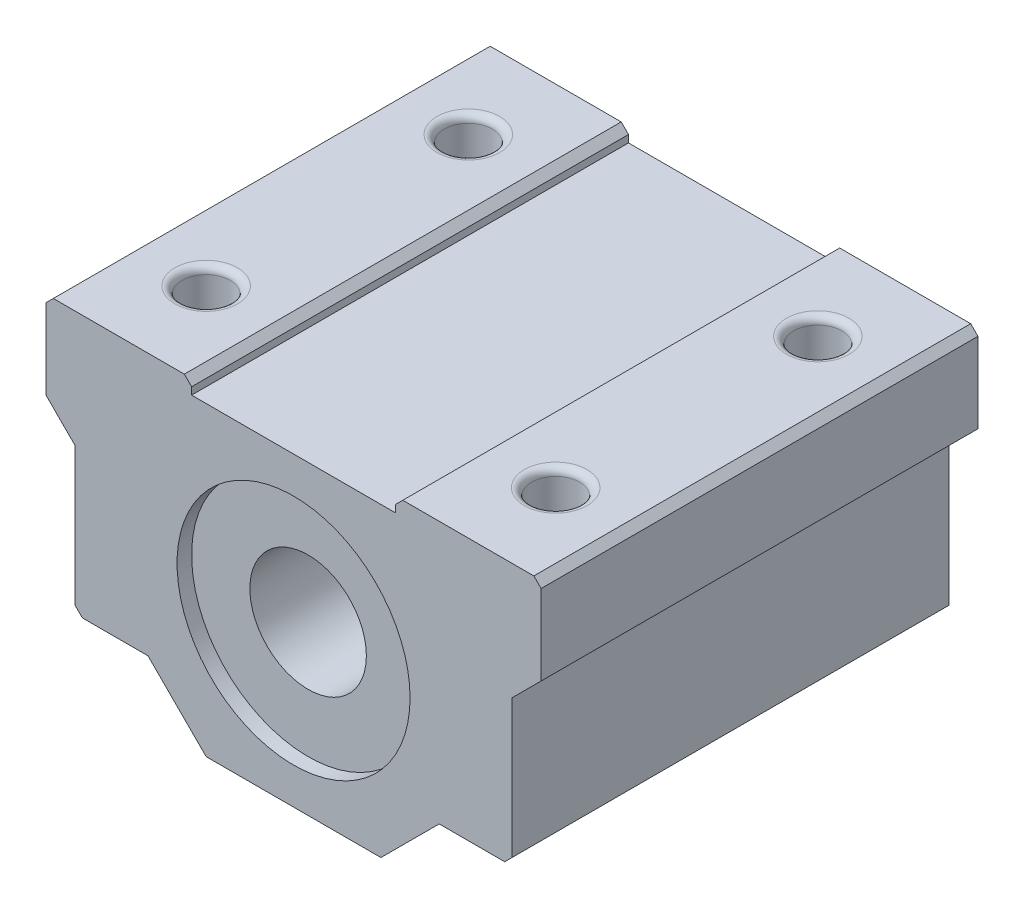
ISO-10303-21;
HEADER;
FILE_DESCRIPTION(('STEP AP214'),'2;1');
FILE_NAME('part.step','',(''),(''),'','','');
FILE_SCHEMA(('AUTOMOTIVE_DESIGN { 1 0 10303 214 1 1 1 1 }'));
ENDSEC;
DATA;
#1=APPLICATION_CONTEXT('core data for automotive mechanical design processes');
#2=APPLICATION_PROTOCOL_DEFINITION('international standard','automotive_design',2000,#1);
#3=PRODUCT_CONTEXT('',#1,'mechanical');
#4=PRODUCT('Part','Part','',(#3));
#5=PRODUCT_RELATED_PRODUCT_CATEGORY('part','',(#4));
#6=PRODUCT_DEFINITION_FORMATION('','',#4);
#7=PRODUCT_DEFINITION_CONTEXT('part definition',#1,'design');
#8=PRODUCT_DEFINITION('design','',#6,#7);
#9=PRODUCT_DEFINITION_SHAPE('','',#8);
#10=(LENGTH_UNIT() NAMED_UNIT(*) SI_UNIT(.MILLI.,.METRE.));
#11=(NAMED_UNIT(*) PLANE_ANGLE_UNIT() SI_UNIT($,.RADIAN.));
#12=(NAMED_UNIT(*) SI_UNIT($,.STERADIAN.) SOLID_ANGLE_UNIT());
#13=UNCERTAINTY_MEASURE_WITH_UNIT(LENGTH_MEASURE(1.E-05),#10,'distance_accuracy_value','');
#14=(GEOMETRIC_REPRESENTATION_CONTEXT(3) GLOBAL_UNCERTAINTY_ASSIGNED_CONTEXT((#13)) GLOBAL_UNIT_ASSIGNED_CONTEXT((#10,
#11,#12)) REPRESENTATION_CONTEXT('',''));
#15=CARTESIAN_POINT('',(0.,0.,0.));
#16=DIRECTION('',(0.,0.,1.));
#17=DIRECTION('',(1.,0.,0.));
#18=AXIS2_PLACEMENT_3D('',#15,#16,#17);
#19=CARTESIAN_POINT('',(0.,0.,15.));
#20=DIRECTION('',(0.,0.,-1.));
#21=DIRECTION('',(-1.,0.,0.));
#22=AXIS2_PLACEMENT_3D('',#19,#20,#21);
#23=CYLINDRICAL_SURFACE('',#22,8.);
#24=CARTESIAN_POINT('',(0.,0.,-15.));
#25=DIRECTION('',(0.,0.,1.));
#26=DIRECTION('',(1.,0.,0.));
#27=AXIS2_PLACEMENT_3D('',#24,#25,#26);
#28=CIRCLE('',#27,8.);
#29=CARTESIAN_POINT('',(8.,0.,-15.));
#30=VERTEX_POINT('',#29);
#31=EDGE_CURVE('E434',#30,#30,#28,.T.);
#32=ORIENTED_EDGE('',*,*,#31,.F.);
#33=EDGE_LOOP('',(#32));
#34=FACE_BOUND('',#33,.T.);
#35=CARTESIAN_POINT('',(0.,0.,-14.));
#36=DIRECTION('',(0.,0.,1.));
#37=DIRECTION('',(1.,0.,0.));
#38=AXIS2_PLACEMENT_3D('',#35,#36,#37);
#39=CIRCLE('',#38,8.);
#40=CARTESIAN_POINT('',(8.,0.,-14.));
#41=VERTEX_POINT('',#40);
#42=EDGE_CURVE('E771',#41,#41,#39,.T.);
#43=ORIENTED_EDGE('',*,*,#42,.T.);
#44=EDGE_LOOP('',(#43));
#45=FACE_BOUND('',#44,.T.);
#46=ADVANCED_FACE('F43',(#34,#45),#23,.F.);
#47=CARTESIAN_POINT('',(0.,0.,15.));
#48=DIRECTION('',(0.,0.,-1.));
#49=DIRECTION('',(-1.,0.,0.));
#50=AXIS2_PLACEMENT_3D('',#47,#48,#49);
#51=PLANE('',#50);
#52=DIRECTION('',(1.,0.,0.));
#53=VECTOR('',#52,1.);
#54=CARTESIAN_POINT('',(10.,-6.5,15.));
#55=LINE('',#54,#53);
#56=CARTESIAN_POINT('',(10.,-6.5,15.));
#57=VERTEX_POINT('',#56);
#58=CARTESIAN_POINT('',(14.5,-6.5,15.));
#59=VERTEX_POINT('',#58);
#60=EDGE_CURVE('E452',#57,#59,#55,.T.);
#61=ORIENTED_EDGE('',*,*,#60,.T.);
#62=DIRECTION('',(-0.707106781186548,-0.707106781186548,0.));
#63=VECTOR('',#62,1.);
#64=CARTESIAN_POINT('',(15.,-6.,15.));
#65=LINE('',#64,#63);
#66=CARTESIAN_POINT('',(15.,-6.,15.));
#67=VERTEX_POINT('',#66);
#68=EDGE_CURVE('E277',#59,#67,#65,.F.);
#69=ORIENTED_EDGE('',*,*,#68,.T.);
#70=DIRECTION('',(0.,1.,0.));
#71=VECTOR('',#70,1.);
#72=CARTESIAN_POINT('',(15.,-6.5,15.));
#73=LINE('',#72,#71);
#74=CARTESIAN_POINT('',(15.,3.5,15.));
#75=VERTEX_POINT('',#74);
#76=EDGE_CURVE('E454',#67,#75,#73,.T.);
#77=ORIENTED_EDGE('',*,*,#76,.T.);
#78=DIRECTION('',(0.707106781186547,0.707106781186547,0.));
#79=VECTOR('',#78,1.);
#80=CARTESIAN_POINT('',(15.,3.5,15.));
#81=LINE('',#80,#79);
#82=CARTESIAN_POINT('',(17.,5.5,15.));
#83=VERTEX_POINT('',#82);
#84=EDGE_CURVE('E456',#75,#83,#81,.T.);
#85=ORIENTED_EDGE('',*,*,#84,.T.);
#86=DIRECTION('',(0.,1.,0.));
#87=VECTOR('',#86,1.);
#88=CARTESIAN_POINT('',(17.,5.5,15.));
#89=LINE('',#88,#87);
#90=CARTESIAN_POINT('',(17.,11.,15.));
#91=VERTEX_POINT('',#90);
#92=EDGE_CURVE('E313',#83,#91,#89,.T.);
#93=ORIENTED_EDGE('',*,*,#92,.T.);
#94=DIRECTION('',(0.707106781186543,-0.707106781186552,0.));
#95=VECTOR('',#94,1.);
#96=CARTESIAN_POINT('',(16.5,11.5,15.));
#97=LINE('',#96,#95);
#98=CARTESIAN_POINT('',(16.5,11.5,15.));
#99=VERTEX_POINT('',#98);
#100=EDGE_CURVE('E269',#91,#99,#97,.F.);
#101=ORIENTED_EDGE('',*,*,#100,.T.);
#102=DIRECTION('',(-1.,0.,0.));
#103=VECTOR('',#102,1.);
#104=CARTESIAN_POINT('',(7.,11.5,15.));
#105=LINE('',#104,#103);
#106=CARTESIAN_POINT('',(7.5,11.5,15.));
#107=VERTEX_POINT('',#106);
#108=EDGE_CURVE('E303',#99,#107,#105,.T.);
#109=ORIENTED_EDGE('',*,*,#108,.T.);
#110=DIRECTION('',(0.707106781186548,0.707106781186548,0.));
#111=VECTOR('',#110,1.);
#112=CARTESIAN_POINT('',(7.,11.,15.));
#113=LINE('',#112,#111);
#114=CARTESIAN_POINT('',(7.,11.,15.));
#115=VERTEX_POINT('',#114);
#116=EDGE_CURVE('E271',#107,#115,#113,.F.);
#117=ORIENTED_EDGE('',*,*,#116,.T.);
#118=DIRECTION('',(0.,-1.,0.));
#119=VECTOR('',#118,1.);
#120=CARTESIAN_POINT('',(7.,10.5,15.));
#121=LINE('',#120,#119);
#122=CARTESIAN_POINT('',(7.,10.5,15.));
#123=VERTEX_POINT('',#122);
#124=EDGE_CURVE('E312',#115,#123,#121,.T.);
#125=ORIENTED_EDGE('',*,*,#124,.T.);
#126=DIRECTION('',(-1.,0.,0.));
#127=VECTOR('',#126,1.);
#128=CARTESIAN_POINT('',(-7.,10.5,15.));
#129=LINE('',#128,#127);
#130=CARTESIAN_POINT('',(-7.,10.5,15.));
#131=VERTEX_POINT('',#130);
#132=EDGE_CURVE('E460',#123,#131,#129,.T.);
#133=ORIENTED_EDGE('',*,*,#132,.T.);
#134=DIRECTION('',(0.,1.,0.));
#135=VECTOR('',#134,1.);
#136=CARTESIAN_POINT('',(-7.,10.5,15.));
#137=LINE('',#136,#135);
#138=CARTESIAN_POINT('',(-7.,11.,15.));
#139=VERTEX_POINT('',#138);
#140=EDGE_CURVE('E462',#131,#139,#137,.T.);
#141=ORIENTED_EDGE('',*,*,#140,.T.);
#142=DIRECTION('',(0.707106781186548,-0.707106781186548,0.));
#143=VECTOR('',#142,1.);
#144=CARTESIAN_POINT('',(-7.5,11.5,15.));
#145=LINE('',#144,#143);
#146=CARTESIAN_POINT('',(-7.5,11.5,15.));
#147=VERTEX_POINT('',#146);
#148=EDGE_CURVE('E65',#139,#147,#145,.F.);
#149=ORIENTED_EDGE('',*,*,#148,.T.);
#150=DIRECTION('',(-1.,0.,0.));
#151=VECTOR('',#150,1.);
#152=CARTESIAN_POINT('',(-17.,11.5,15.));
#153=LINE('',#152,#151);
#154=CARTESIAN_POINT('',(-16.5,11.5,15.));
#155=VERTEX_POINT('',#154);
#156=EDGE_CURVE('E344',#147,#155,#153,.T.);
#157=ORIENTED_EDGE('',*,*,#156,.T.);
#158=DIRECTION('',(0.707106781186548,0.707106781186548,0.));
#159=VECTOR('',#158,1.);
#160=CARTESIAN_POINT('',(-17.,11.,15.));
#161=LINE('',#160,#159);
#162=CARTESIAN_POINT('',(-17.,11.,15.));
#163=VERTEX_POINT('',#162);
#164=EDGE_CURVE('E200',#155,#163,#161,.F.);
#165=ORIENTED_EDGE('',*,*,#164,.T.);
#166=DIRECTION('',(0.,-1.,0.));
#167=VECTOR('',#166,1.);
#168=CARTESIAN_POINT('',(-17.,5.5,15.));
#169=LINE('',#168,#167);
#170=CARTESIAN_POINT('',(-17.,5.5,15.));
#171=VERTEX_POINT('',#170);
#172=EDGE_CURVE('E191',#163,#171,#169,.T.);
#173=ORIENTED_EDGE('',*,*,#172,.T.);
#174=DIRECTION('',(0.707106781186547,-0.707106781186547,0.));
#175=VECTOR('',#174,1.);
#176=CARTESIAN_POINT('',(-15.,3.5,15.));
#177=LINE('',#176,#175);
#178=CARTESIAN_POINT('',(-15.,3.5,15.));
#179=VERTEX_POINT('',#178);
#180=EDGE_CURVE('E197',#171,#179,#177,.T.);
#181=ORIENTED_EDGE('',*,*,#180,.T.);
#182=DIRECTION('',(0.,-1.,0.));
#183=VECTOR('',#182,1.);
#184=CARTESIAN_POINT('',(-15.,-6.5,15.));
#185=LINE('',#184,#183);
#186=CARTESIAN_POINT('',(-15.,-6.,15.));
#187=VERTEX_POINT('',#186);
#188=EDGE_CURVE('E214',#179,#187,#185,.T.);
#189=ORIENTED_EDGE('',*,*,#188,.T.);
#190=DIRECTION('',(-0.707106781186548,0.707106781186548,0.));
#191=VECTOR('',#190,1.);
#192=CARTESIAN_POINT('',(-14.5,-6.5,15.));
#193=LINE('',#192,#191);
#194=CARTESIAN_POINT('',(-14.5,-6.5,15.));
#195=VERTEX_POINT('',#194);
#196=EDGE_CURVE('E275',#187,#195,#193,.F.);
#197=ORIENTED_EDGE('',*,*,#196,.T.);
#198=DIRECTION('',(1.,0.,0.));
#199=VECTOR('',#198,1.);
#200=CARTESIAN_POINT('',(-10.,-6.5,15.));
#201=LINE('',#200,#199);
#202=CARTESIAN_POINT('',(-10.,-6.5,15.));
#203=VERTEX_POINT('',#202);
#204=EDGE_CURVE('E445',#195,#203,#201,.T.);
#205=ORIENTED_EDGE('',*,*,#204,.T.);
#206=DIRECTION('',(0.707106781186548,-0.707106781186548,0.));
#207=VECTOR('',#206,1.);
#208=CARTESIAN_POINT('',(-6.,-10.5,15.));
#209=LINE('',#208,#207);
#210=CARTESIAN_POINT('',(-6.,-10.5,15.));
#211=VERTEX_POINT('',#210);
#212=EDGE_CURVE('E368',#203,#211,#209,.T.);
#213=ORIENTED_EDGE('',*,*,#212,.T.);
#214=DIRECTION('',(1.,0.,0.));
#215=VECTOR('',#214,1.);
#216=CARTESIAN_POINT('',(-6.,-10.5,15.));
#217=LINE('',#216,#215);
#218=CARTESIAN_POINT('',(6.,-10.5,15.));
#219=VERTEX_POINT('',#218);
#220=EDGE_CURVE('E448',#211,#219,#217,.T.);
#221=ORIENTED_EDGE('',*,*,#220,.T.);
#222=DIRECTION('',(0.707106781186548,0.707106781186547,0.));
#223=VECTOR('',#222,1.);
#224=CARTESIAN_POINT('',(6.,-10.5,15.));
#225=LINE('',#224,#223);
#226=EDGE_CURVE('E450',#219,#57,#225,.T.);
#227=ORIENTED_EDGE('',*,*,#226,.T.);
#228=EDGE_LOOP('',(#61,#69,#77,#85,#93,#101,#109,#117,#125,#133,#141,#149,#157,#165,#173,#181,
#189,#197,#205,#213,#221,#227));
#229=FACE_BOUND('',#228,.T.);
#230=CARTESIAN_POINT('',(0.,0.,15.));
#231=DIRECTION('',(0.,0.,1.));
#232=DIRECTION('',(1.,0.,0.));
#233=AXIS2_PLACEMENT_3D('',#230,#231,#232);
#234=CIRCLE('',#233,8.);
#235=CARTESIAN_POINT('',(8.,0.,15.));
#236=VERTEX_POINT('',#235);
#237=EDGE_CURVE('E433',#236,#236,#234,.T.);
#238=ORIENTED_EDGE('',*,*,#237,.F.);
#239=EDGE_LOOP('',(#238));
#240=FACE_BOUND('',#239,.T.);
#241=ADVANCED_FACE('F194',(#229,#240),#51,.F.);
#242=CARTESIAN_POINT('',(0.,0.,-15.));
#243=DIRECTION('',(0.,0.,-1.));
#244=DIRECTION('',(-1.,0.,0.));
#245=AXIS2_PLACEMENT_3D('',#242,#243,#244);
#246=PLANE('',#245);
#247=DIRECTION('',(0.,1.,0.));
#248=VECTOR('',#247,1.);
#249=CARTESIAN_POINT('',(15.,-6.5,-15.));
#250=LINE('',#249,#248);
#251=CARTESIAN_POINT('',(15.,-6.,-15.));
#252=VERTEX_POINT('',#251);
#253=CARTESIAN_POINT('',(15.,3.5,-15.));
#254=VERTEX_POINT('',#253);
#255=EDGE_CURVE('E387',#252,#254,#250,.T.);
#256=ORIENTED_EDGE('',*,*,#255,.F.);
#257=DIRECTION('',(0.707106781186548,0.707106781186548,0.));
#258=VECTOR('',#257,1.);
#259=CARTESIAN_POINT('',(10.5,-10.5,-15.));
#260=LINE('',#259,#258);
#261=CARTESIAN_POINT('',(14.5,-6.5,-15.));
#262=VERTEX_POINT('',#261);
#263=EDGE_CURVE('E265',#252,#262,#260,.F.);
#264=ORIENTED_EDGE('',*,*,#263,.T.);
#265=DIRECTION('',(1.,0.,0.));
#266=VECTOR('',#265,1.);
#267=CARTESIAN_POINT('',(10.,-6.5,-15.));
#268=LINE('',#267,#266);
#269=CARTESIAN_POINT('',(10.,-6.5,-15.));
#270=VERTEX_POINT('',#269);
#271=EDGE_CURVE('E384',#270,#262,#268,.T.);
#272=ORIENTED_EDGE('',*,*,#271,.F.);
#273=DIRECTION('',(0.707106781186548,0.707106781186547,0.));
#274=VECTOR('',#273,1.);
#275=CARTESIAN_POINT('',(6.,-10.5,-15.));
#276=LINE('',#275,#274);
#277=CARTESIAN_POINT('',(6.,-10.5,-15.));
#278=VERTEX_POINT('',#277);
#279=EDGE_CURVE('E377',#278,#270,#276,.T.);
#280=ORIENTED_EDGE('',*,*,#279,.F.);
#281=DIRECTION('',(1.,0.,0.));
#282=VECTOR('',#281,1.);
#283=CARTESIAN_POINT('',(-6.,-10.5,-15.));
#284=LINE('',#283,#282);
#285=CARTESIAN_POINT('',(-6.,-10.5,-15.));
#286=VERTEX_POINT('',#285);
#287=EDGE_CURVE('E375',#286,#278,#284,.T.);
#288=ORIENTED_EDGE('',*,*,#287,.F.);
#289=DIRECTION('',(0.707106781186548,-0.707106781186548,0.));
#290=VECTOR('',#289,1.);
#291=CARTESIAN_POINT('',(-6.,-10.5,-15.));
#292=LINE('',#291,#290);
#293=CARTESIAN_POINT('',(-10.,-6.5,-15.));
#294=VERTEX_POINT('',#293);
#295=EDGE_CURVE('E367',#294,#286,#292,.T.);
#296=ORIENTED_EDGE('',*,*,#295,.F.);
#297=DIRECTION('',(1.,0.,0.));
#298=VECTOR('',#297,1.);
#299=CARTESIAN_POINT('',(-10.,-6.5,-15.));
#300=LINE('',#299,#298);
#301=CARTESIAN_POINT('',(-14.5,-6.5,-15.));
#302=VERTEX_POINT('',#301);
#303=EDGE_CURVE('E373',#302,#294,#300,.T.);
#304=ORIENTED_EDGE('',*,*,#303,.F.);
#305=DIRECTION('',(0.707106781186548,-0.707106781186548,0.));
#306=VECTOR('',#305,1.);
#307=CARTESIAN_POINT('',(-10.5,-10.5,-15.));
#308=LINE('',#307,#306);
#309=CARTESIAN_POINT('',(-15.,-6.,-15.));
#310=VERTEX_POINT('',#309);
#311=EDGE_CURVE('E263',#302,#310,#308,.F.);
#312=ORIENTED_EDGE('',*,*,#311,.T.);
#313=DIRECTION('',(0.,-1.,0.));
#314=VECTOR('',#313,1.);
#315=CARTESIAN_POINT('',(-15.,-6.5,-15.));
#316=LINE('',#315,#314);
#317=CARTESIAN_POINT('',(-15.,3.5,-15.));
#318=VERTEX_POINT('',#317);
#319=EDGE_CURVE('E379',#318,#310,#316,.T.);
#320=ORIENTED_EDGE('',*,*,#319,.F.);
#321=DIRECTION('',(0.707106781186547,-0.707106781186547,0.));
#322=VECTOR('',#321,1.);
#323=CARTESIAN_POINT('',(-15.,3.5,-15.));
#324=LINE('',#323,#322);
#325=CARTESIAN_POINT('',(-17.,5.5,-15.));
#326=VERTEX_POINT('',#325);
#327=EDGE_CURVE('E436',#326,#318,#324,.T.);
#328=ORIENTED_EDGE('',*,*,#327,.F.);
#329=DIRECTION('',(0.,-1.,0.));
#330=VECTOR('',#329,1.);
#331=CARTESIAN_POINT('',(-17.,5.5,-15.));
#332=LINE('',#331,#330);
#333=CARTESIAN_POINT('',(-17.,11.,-15.));
#334=VERTEX_POINT('',#333);
#335=EDGE_CURVE('E218',#334,#326,#332,.T.);
#336=ORIENTED_EDGE('',*,*,#335,.F.);
#337=DIRECTION('',(-0.707106781186548,-0.707106781186548,0.));
#338=VECTOR('',#337,1.);
#339=CARTESIAN_POINT('',(-14.,14.,-15.));
#340=LINE('',#339,#338);
#341=CARTESIAN_POINT('',(-16.5,11.5,-15.));
#342=VERTEX_POINT('',#341);
#343=EDGE_CURVE('E261',#334,#342,#340,.F.);
#344=ORIENTED_EDGE('',*,*,#343,.T.);
#345=DIRECTION('',(-1.,0.,0.));
#346=VECTOR('',#345,1.);
#347=CARTESIAN_POINT('',(-17.,11.5,-15.));
#348=LINE('',#347,#346);
#349=CARTESIAN_POINT('',(-7.5,11.5,-15.));
#350=VERTEX_POINT('',#349);
#351=EDGE_CURVE('E205',#350,#342,#348,.T.);
#352=ORIENTED_EDGE('',*,*,#351,.F.);
#353=DIRECTION('',(-0.707106781186548,0.707106781186548,0.));
#354=VECTOR('',#353,1.);
#355=CARTESIAN_POINT('',(2.,2.,-15.));
#356=LINE('',#355,#354);
#357=CARTESIAN_POINT('',(-7.,11.,-15.));
#358=VERTEX_POINT('',#357);
#359=EDGE_CURVE('E259',#350,#358,#356,.F.);
#360=ORIENTED_EDGE('',*,*,#359,.T.);
#361=DIRECTION('',(0.,1.,0.));
#362=VECTOR('',#361,1.);
#363=CARTESIAN_POINT('',(-7.,10.5,-15.));
#364=LINE('',#363,#362);
#365=CARTESIAN_POINT('',(-7.,10.5,-15.));
#366=VERTEX_POINT('',#365);
#367=EDGE_CURVE('E331',#366,#358,#364,.T.);
#368=ORIENTED_EDGE('',*,*,#367,.F.);
#369=DIRECTION('',(-1.,0.,0.));
#370=VECTOR('',#369,1.);
#371=CARTESIAN_POINT('',(-7.,10.5,-15.));
#372=LINE('',#371,#370);
#373=CARTESIAN_POINT('',(7.,10.5,-15.));
#374=VERTEX_POINT('',#373);
#375=EDGE_CURVE('E329',#374,#366,#372,.T.);
#376=ORIENTED_EDGE('',*,*,#375,.F.);
#377=DIRECTION('',(0.,-1.,0.));
#378=VECTOR('',#377,1.);
#379=CARTESIAN_POINT('',(7.,10.5,-15.));
#380=LINE('',#379,#378);
#381=CARTESIAN_POINT('',(7.,11.,-15.));
#382=VERTEX_POINT('',#381);
#383=EDGE_CURVE('E321',#382,#374,#380,.T.);
#384=ORIENTED_EDGE('',*,*,#383,.F.);
#385=DIRECTION('',(-0.707106781186548,-0.707106781186548,0.));
#386=VECTOR('',#385,1.);
#387=CARTESIAN_POINT('',(-2.,2.,-15.));
#388=LINE('',#387,#386);
#389=CARTESIAN_POINT('',(7.5,11.5,-15.));
#390=VERTEX_POINT('',#389);
#391=EDGE_CURVE('E257',#382,#390,#388,.F.);
#392=ORIENTED_EDGE('',*,*,#391,.T.);
#393=DIRECTION('',(-1.,0.,0.));
#394=VECTOR('',#393,1.);
#395=CARTESIAN_POINT('',(7.,11.5,-15.));
#396=LINE('',#395,#394);
#397=CARTESIAN_POINT('',(16.5,11.5,-15.));
#398=VERTEX_POINT('',#397);
#399=EDGE_CURVE('E306',#398,#390,#396,.T.);
#400=ORIENTED_EDGE('',*,*,#399,.F.);
#401=DIRECTION('',(-0.707106781186543,0.707106781186552,0.));
#402=VECTOR('',#401,1.);
#403=CARTESIAN_POINT('',(14.0000000000001,13.9999999999999,-15.));
#404=LINE('',#403,#402);
#405=CARTESIAN_POINT('',(17.,11.,-15.));
#406=VERTEX_POINT('',#405);
#407=EDGE_CURVE('E255',#398,#406,#404,.F.);
#408=ORIENTED_EDGE('',*,*,#407,.T.);
#409=DIRECTION('',(0.,1.,0.));
#410=VECTOR('',#409,1.);
#411=CARTESIAN_POINT('',(17.,5.5,-15.));
#412=LINE('',#411,#410);
#413=CARTESIAN_POINT('',(17.,5.5,-15.));
#414=VERTEX_POINT('',#413);
#415=EDGE_CURVE('E333',#414,#406,#412,.T.);
#416=ORIENTED_EDGE('',*,*,#415,.F.);
#417=DIRECTION('',(0.707106781186547,0.707106781186547,0.));
#418=VECTOR('',#417,1.);
#419=CARTESIAN_POINT('',(15.,3.5,-15.));
#420=LINE('',#419,#418);
#421=EDGE_CURVE('E389',#254,#414,#420,.T.);
#422=ORIENTED_EDGE('',*,*,#421,.F.);
#423=EDGE_LOOP('',(#256,#264,#272,#280,#288,#296,#304,#312,#320,#328,#336,#344,#352,#360,#368,
#376,#384,#392,#400,#408,#416,#422));
#424=FACE_BOUND('',#423,.T.);
#425=ORIENTED_EDGE('',*,*,#31,.T.);
#426=EDGE_LOOP('',(#425));
#427=FACE_BOUND('',#426,.T.);
#428=ADVANCED_FACE('F326',(#424,#427),#246,.T.);
#429=CARTESIAN_POINT('',(-17.,5.5,15.));
#430=DIRECTION('',(1.,0.,0.));
#431=DIRECTION('',(0.,0.,-1.));
#432=AXIS2_PLACEMENT_3D('',#429,#430,#431);
#433=PLANE('',#432);
#434=ORIENTED_EDGE('',*,*,#172,.F.);
#435=DIRECTION('',(0.,0.,-1.));
#436=VECTOR('',#435,1.);
#437=CARTESIAN_POINT('',(-17.,11.,15.));
#438=LINE('',#437,#436);
#439=EDGE_CURVE('E284',#163,#334,#438,.T.);
#440=ORIENTED_EDGE('',*,*,#439,.T.);
#441=ORIENTED_EDGE('',*,*,#335,.T.);
#442=DIRECTION('',(0.,0.,-1.));
#443=VECTOR('',#442,1.);
#444=CARTESIAN_POINT('',(-17.,5.5,15.));
#445=LINE('',#444,#443);
#446=EDGE_CURVE('E210',#171,#326,#445,.T.);
#447=ORIENTED_EDGE('',*,*,#446,.F.);
#448=EDGE_LOOP('',(#434,#440,#441,#447));
#449=FACE_BOUND('',#448,.T.);
#450=ADVANCED_FACE('F216',(#449),#433,.F.);
#451=CARTESIAN_POINT('',(-15.,3.5,15.));
#452=DIRECTION('',(0.707106781186547,0.707106781186547,0.));
#453=DIRECTION('',(-0.707106781186548,0.707106781186548,0.));
#454=AXIS2_PLACEMENT_3D('',#451,#452,#453);
#455=PLANE('',#454);
#456=ORIENTED_EDGE('',*,*,#327,.T.);
#457=DIRECTION('',(0.,0.,-1.));
#458=VECTOR('',#457,1.);
#459=CARTESIAN_POINT('',(-15.,3.5,15.));
#460=LINE('',#459,#458);
#461=EDGE_CURVE('E212',#179,#318,#460,.T.);
#462=ORIENTED_EDGE('',*,*,#461,.F.);
#463=ORIENTED_EDGE('',*,*,#180,.F.);
#464=ORIENTED_EDGE('',*,*,#446,.T.);
#465=EDGE_LOOP('',(#456,#462,#463,#464));
#466=FACE_BOUND('',#465,.T.);
#467=ADVANCED_FACE('F209',(#466),#455,.F.);
#468=CARTESIAN_POINT('',(-15.,-6.5,15.));
#469=DIRECTION('',(1.,0.,0.));
#470=DIRECTION('',(0.,0.,-1.));
#471=AXIS2_PLACEMENT_3D('',#468,#469,#470);
#472=PLANE('',#471);
#473=ORIENTED_EDGE('',*,*,#319,.T.);
#474=DIRECTION('',(0.,0.,1.));
#475=VECTOR('',#474,1.);
#476=CARTESIAN_POINT('',(-15.,-6.,15.));
#477=LINE('',#476,#475);
#478=EDGE_CURVE('E282',#310,#187,#477,.T.);
#479=ORIENTED_EDGE('',*,*,#478,.T.);
#480=ORIENTED_EDGE('',*,*,#188,.F.);
#481=ORIENTED_EDGE('',*,*,#461,.T.);
#482=EDGE_LOOP('',(#473,#479,#480,#481));
#483=FACE_BOUND('',#482,.T.);
#484=ADVANCED_FACE('F469',(#483),#472,.F.);
#485=CARTESIAN_POINT('',(-10.,-6.5,15.));
#486=DIRECTION('',(0.,1.,0.));
#487=DIRECTION('',(0.,0.,1.));
#488=AXIS2_PLACEMENT_3D('',#485,#486,#487);
#489=PLANE('',#488);
#490=CARTESIAN_POINT('',(-12.,-6.5,9.));
#491=DIRECTION('',(0.,1.,0.));
#492=DIRECTION('',(0.,0.,1.));
#493=AXIS2_PLACEMENT_3D('',#490,#491,#492);
#494=CIRCLE('',#493,1.65);
#495=CARTESIAN_POINT('',(-12.,-6.5,10.65));
#496=VERTEX_POINT('',#495);
#497=EDGE_CURVE('E776',#496,#496,#494,.T.);
#498=ORIENTED_EDGE('',*,*,#497,.T.);
#499=EDGE_LOOP('',(#498));
#500=FACE_BOUND('',#499,.T.);
#501=CARTESIAN_POINT('',(-12.,-6.5,-9.));
#502=DIRECTION('',(0.,1.,0.));
#503=DIRECTION('',(0.,0.,1.));
#504=AXIS2_PLACEMENT_3D('',#501,#502,#503);
#505=CIRCLE('',#504,1.65);
#506=CARTESIAN_POINT('',(-12.,-6.5,-7.35));
#507=VERTEX_POINT('',#506);
#508=EDGE_CURVE('E439',#507,#507,#505,.T.);
#509=ORIENTED_EDGE('',*,*,#508,.T.);
#510=EDGE_LOOP('',(#509));
#511=FACE_BOUND('',#510,.T.);
#512=ORIENTED_EDGE('',*,*,#204,.F.);
#513=DIRECTION('',(0.,0.,-1.));
#514=VECTOR('',#513,1.);
#515=CARTESIAN_POINT('',(-14.5,-6.5,15.));
#516=LINE('',#515,#514);
#517=EDGE_CURVE('E279',#195,#302,#516,.T.);
#518=ORIENTED_EDGE('',*,*,#517,.T.);
#519=ORIENTED_EDGE('',*,*,#303,.T.);
#520=DIRECTION('',(0.,0.,-1.));
#521=VECTOR('',#520,1.);
#522=CARTESIAN_POINT('',(-10.,-6.5,15.));
#523=LINE('',#522,#521);
#524=EDGE_CURVE('E225',#203,#294,#523,.T.);
#525=ORIENTED_EDGE('',*,*,#524,.F.);
#526=EDGE_LOOP('',(#512,#518,#519,#525));
#527=FACE_BOUND('',#526,.T.);
#528=ADVANCED_FACE('F474',(#500,#511,#527),#489,.F.);
#529=CARTESIAN_POINT('',(-6.,-10.5,15.));
#530=DIRECTION('',(0.707106781186548,0.707106781186548,0.));
#531=DIRECTION('',(-0.707106781186548,0.707106781186548,0.));
#532=AXIS2_PLACEMENT_3D('',#529,#530,#531);
#533=PLANE('',#532);
#534=ORIENTED_EDGE('',*,*,#295,.T.);
#535=DIRECTION('',(0.,0.,-1.));
#536=VECTOR('',#535,1.);
#537=CARTESIAN_POINT('',(-6.,-10.5,15.));
#538=LINE('',#537,#536);
#539=EDGE_CURVE('E358',#211,#286,#538,.T.);
#540=ORIENTED_EDGE('',*,*,#539,.F.);
#541=ORIENTED_EDGE('',*,*,#212,.F.);
#542=ORIENTED_EDGE('',*,*,#524,.T.);
#543=EDGE_LOOP('',(#534,#540,#541,#542));
#544=FACE_BOUND('',#543,.T.);
#545=ADVANCED_FACE('F365',(#544),#533,.F.);
#546=CARTESIAN_POINT('',(-6.,-10.5,15.));
#547=DIRECTION('',(0.,1.,0.));
#548=DIRECTION('',(0.,0.,1.));
#549=AXIS2_PLACEMENT_3D('',#546,#547,#548);
#550=PLANE('',#549);
#551=ORIENTED_EDGE('',*,*,#287,.T.);
#552=DIRECTION('',(0.,0.,-1.));
#553=VECTOR('',#552,1.);
#554=CARTESIAN_POINT('',(6.,-10.5,15.));
#555=LINE('',#554,#553);
#556=EDGE_CURVE('E355',#219,#278,#555,.T.);
#557=ORIENTED_EDGE('',*,*,#556,.F.);
#558=ORIENTED_EDGE('',*,*,#220,.F.);
#559=ORIENTED_EDGE('',*,*,#539,.T.);
#560=EDGE_LOOP('',(#551,#557,#558,#559));
#561=FACE_BOUND('',#560,.T.);
#562=ADVANCED_FACE('F483',(#561),#550,.F.);
#563=CARTESIAN_POINT('',(6.,-10.5,15.));
#564=DIRECTION('',(-0.707106781186547,0.707106781186548,0.));
#565=DIRECTION('',(-0.707106781186548,-0.707106781186547,0.));
#566=AXIS2_PLACEMENT_3D('',#563,#564,#565);
#567=PLANE('',#566);
#568=ORIENTED_EDGE('',*,*,#279,.T.);
#569=DIRECTION('',(0.,0.,-1.));
#570=VECTOR('',#569,1.);
#571=CARTESIAN_POINT('',(10.,-6.5,15.));
#572=LINE('',#571,#570);
#573=EDGE_CURVE('E352',#57,#270,#572,.T.);
#574=ORIENTED_EDGE('',*,*,#573,.F.);
#575=ORIENTED_EDGE('',*,*,#226,.F.);
#576=ORIENTED_EDGE('',*,*,#556,.T.);
#577=EDGE_LOOP('',(#568,#574,#575,#576));
#578=FACE_BOUND('',#577,.T.);
#579=ADVANCED_FACE('F559',(#578),#567,.F.);
#580=CARTESIAN_POINT('',(10.,-6.5,15.));
#581=DIRECTION('',(0.,1.,0.));
#582=DIRECTION('',(0.,0.,1.));
#583=AXIS2_PLACEMENT_3D('',#580,#581,#582);
#584=PLANE('',#583);
#585=CARTESIAN_POINT('',(12.,-6.5,9.));
#586=DIRECTION('',(0.,1.,0.));
#587=DIRECTION('',(0.,0.,1.));
#588=AXIS2_PLACEMENT_3D('',#585,#586,#587);
#589=CIRCLE('',#588,1.65);
#590=CARTESIAN_POINT('',(12.,-6.5,10.65));
#591=VERTEX_POINT('',#590);
#592=EDGE_CURVE('E780',#591,#591,#589,.T.);
#593=ORIENTED_EDGE('',*,*,#592,.T.);
#594=EDGE_LOOP('',(#593));
#595=FACE_BOUND('',#594,.T.);
#596=CARTESIAN_POINT('',(12.,-6.5,-9.));
#597=DIRECTION('',(0.,1.,0.));
#598=DIRECTION('',(0.,0.,1.));
#599=AXIS2_PLACEMENT_3D('',#596,#597,#598);
#600=CIRCLE('',#599,1.65);
#601=CARTESIAN_POINT('',(12.,-6.5,-7.35));
#602=VERTEX_POINT('',#601);
#603=EDGE_CURVE('E778',#602,#602,#600,.T.);
#604=ORIENTED_EDGE('',*,*,#603,.T.);
#605=EDGE_LOOP('',(#604));
#606=FACE_BOUND('',#605,.T.);
#607=ORIENTED_EDGE('',*,*,#271,.T.);
#608=DIRECTION('',(0.,0.,1.));
#609=VECTOR('',#608,1.);
#610=CARTESIAN_POINT('',(14.5,-6.5,15.));
#611=LINE('',#610,#609);
#612=EDGE_CURVE('E267',#262,#59,#611,.T.);
#613=ORIENTED_EDGE('',*,*,#612,.T.);
#614=ORIENTED_EDGE('',*,*,#60,.F.);
#615=ORIENTED_EDGE('',*,*,#573,.T.);
#616=EDGE_LOOP('',(#607,#613,#614,#615));
#617=FACE_BOUND('',#616,.T.);
#618=ADVANCED_FACE('F556',(#595,#606,#617),#584,.F.);
#619=CARTESIAN_POINT('',(15.,-6.5,15.));
#620=DIRECTION('',(-1.,0.,0.));
#621=DIRECTION('',(0.,0.,1.));
#622=AXIS2_PLACEMENT_3D('',#619,#620,#621);
#623=PLANE('',#622);
#624=ORIENTED_EDGE('',*,*,#76,.F.);
#625=DIRECTION('',(0.,0.,-1.));
#626=VECTOR('',#625,1.);
#627=CARTESIAN_POINT('',(15.,-6.,15.));
#628=LINE('',#627,#626);
#629=EDGE_CURVE('E252',#67,#252,#628,.T.);
#630=ORIENTED_EDGE('',*,*,#629,.T.);
#631=ORIENTED_EDGE('',*,*,#255,.T.);
#632=DIRECTION('',(0.,0.,-1.));
#633=VECTOR('',#632,1.);
#634=CARTESIAN_POINT('',(15.,3.5,15.));
#635=LINE('',#634,#633);
#636=EDGE_CURVE('E349',#75,#254,#635,.T.);
#637=ORIENTED_EDGE('',*,*,#636,.F.);
#638=EDGE_LOOP('',(#624,#630,#631,#637));
#639=FACE_BOUND('',#638,.T.);
#640=ADVANCED_FACE('F552',(#639),#623,.F.);
#641=CARTESIAN_POINT('',(15.,3.5,15.));
#642=DIRECTION('',(-0.707106781186547,0.707106781186547,0.));
#643=DIRECTION('',(-0.707106781186548,-0.707106781186548,0.));
#644=AXIS2_PLACEMENT_3D('',#641,#642,#643);
#645=PLANE('',#644);
#646=ORIENTED_EDGE('',*,*,#421,.T.);
#647=DIRECTION('',(0.,0.,-1.));
#648=VECTOR('',#647,1.);
#649=CARTESIAN_POINT('',(17.,5.5,15.));
#650=LINE('',#649,#648);
#651=EDGE_CURVE('E346',#83,#414,#650,.T.);
#652=ORIENTED_EDGE('',*,*,#651,.F.);
#653=ORIENTED_EDGE('',*,*,#84,.F.);
#654=ORIENTED_EDGE('',*,*,#636,.T.);
#655=EDGE_LOOP('',(#646,#652,#653,#654));
#656=FACE_BOUND('',#655,.T.);
#657=ADVANCED_FACE('F550',(#656),#645,.F.);
#658=CARTESIAN_POINT('',(17.,5.5,15.));
#659=DIRECTION('',(-1.,0.,0.));
#660=DIRECTION('',(0.,0.,1.));
#661=AXIS2_PLACEMENT_3D('',#658,#659,#660);
#662=PLANE('',#661);
#663=ORIENTED_EDGE('',*,*,#415,.T.);
#664=DIRECTION('',(0.,0.,1.));
#665=VECTOR('',#664,1.);
#666=CARTESIAN_POINT('',(17.,11.,15.));
#667=LINE('',#666,#665);
#668=EDGE_CURVE('E11',#406,#91,#667,.T.);
#669=ORIENTED_EDGE('',*,*,#668,.T.);
#670=ORIENTED_EDGE('',*,*,#92,.F.);
#671=ORIENTED_EDGE('',*,*,#651,.T.);
#672=EDGE_LOOP('',(#663,#669,#670,#671));
#673=FACE_BOUND('',#672,.T.);
#674=ADVANCED_FACE('F394',(#673),#662,.F.);
#675=CARTESIAN_POINT('',(7.,11.5,15.));
#676=DIRECTION('',(0.,-1.,0.));
#677=DIRECTION('',(0.,0.,-1.));
#678=AXIS2_PLACEMENT_3D('',#675,#676,#677);
#679=PLANE('',#678);
#680=CARTESIAN_POINT('',(12.,11.5,-9.));
#681=DIRECTION('',(0.,-1.,0.));
#682=DIRECTION('',(0.,0.,-1.));
#683=AXIS2_PLACEMENT_3D('',#680,#681,#682);
#684=CIRCLE('',#683,2.15);
#685=CARTESIAN_POINT('',(12.,11.5,-11.15));
#686=VERTEX_POINT('',#685);
#687=EDGE_CURVE('E234',#686,#686,#684,.T.);
#688=ORIENTED_EDGE('',*,*,#687,.T.);
#689=EDGE_LOOP('',(#688));
#690=FACE_BOUND('',#689,.T.);
#691=CARTESIAN_POINT('',(12.,11.5,9.));
#692=DIRECTION('',(0.,-1.,0.));
#693=DIRECTION('',(0.,0.,-1.));
#694=AXIS2_PLACEMENT_3D('',#691,#692,#693);
#695=CIRCLE('',#694,2.15);
#696=CARTESIAN_POINT('',(12.,11.5,6.85));
#697=VERTEX_POINT('',#696);
#698=EDGE_CURVE('E231',#697,#697,#695,.T.);
#699=ORIENTED_EDGE('',*,*,#698,.T.);
#700=EDGE_LOOP('',(#699));
#701=FACE_BOUND('',#700,.T.);
#702=ORIENTED_EDGE('',*,*,#399,.T.);
#703=DIRECTION('',(0.,0.,1.));
#704=VECTOR('',#703,1.);
#705=CARTESIAN_POINT('',(7.5,11.5,15.));
#706=LINE('',#705,#704);
#707=EDGE_CURVE('E51',#390,#107,#706,.T.);
#708=ORIENTED_EDGE('',*,*,#707,.T.);
#709=ORIENTED_EDGE('',*,*,#108,.F.);
#710=DIRECTION('',(0.,0.,-1.));
#711=VECTOR('',#710,1.);
#712=CARTESIAN_POINT('',(16.5,11.5,15.));
#713=LINE('',#712,#711);
#714=EDGE_CURVE('E295',#99,#398,#713,.T.);
#715=ORIENTED_EDGE('',*,*,#714,.T.);
#716=EDGE_LOOP('',(#702,#708,#709,#715));
#717=FACE_BOUND('',#716,.T.);
#718=ADVANCED_FACE('F302',(#690,#701,#717),#679,.F.);
#719=CARTESIAN_POINT('',(7.,10.5,15.));
#720=DIRECTION('',(1.,0.,0.));
#721=DIRECTION('',(0.,0.,-1.));
#722=AXIS2_PLACEMENT_3D('',#719,#720,#721);
#723=PLANE('',#722);
#724=ORIENTED_EDGE('',*,*,#124,.F.);
#725=DIRECTION('',(0.,0.,-1.));
#726=VECTOR('',#725,1.);
#727=CARTESIAN_POINT('',(7.,11.,15.));
#728=LINE('',#727,#726);
#729=EDGE_CURVE('E292',#115,#382,#728,.T.);
#730=ORIENTED_EDGE('',*,*,#729,.T.);
#731=ORIENTED_EDGE('',*,*,#383,.T.);
#732=DIRECTION('',(0.,0.,-1.));
#733=VECTOR('',#732,1.);
#734=CARTESIAN_POINT('',(7.,10.5,15.));
#735=LINE('',#734,#733);
#736=EDGE_CURVE('E343',#123,#374,#735,.T.);
#737=ORIENTED_EDGE('',*,*,#736,.F.);
#738=EDGE_LOOP('',(#724,#730,#731,#737));
#739=FACE_BOUND('',#738,.T.);
#740=ADVANCED_FACE('F319',(#739),#723,.F.);
#741=CARTESIAN_POINT('',(-7.,10.5,15.));
#742=DIRECTION('',(0.,-1.,0.));
#743=DIRECTION('',(0.,0.,-1.));
#744=AXIS2_PLACEMENT_3D('',#741,#742,#743);
#745=PLANE('',#744);
#746=ORIENTED_EDGE('',*,*,#375,.T.);
#747=DIRECTION('',(0.,0.,-1.));
#748=VECTOR('',#747,1.);
#749=CARTESIAN_POINT('',(-7.,10.5,15.));
#750=LINE('',#749,#748);
#751=EDGE_CURVE('E340',#131,#366,#750,.T.);
#752=ORIENTED_EDGE('',*,*,#751,.F.);
#753=ORIENTED_EDGE('',*,*,#132,.F.);
#754=ORIENTED_EDGE('',*,*,#736,.T.);
#755=EDGE_LOOP('',(#746,#752,#753,#754));
#756=FACE_BOUND('',#755,.T.);
#757=ADVANCED_FACE('F533',(#756),#745,.F.);
#758=CARTESIAN_POINT('',(-7.,10.5,15.));
#759=DIRECTION('',(-1.,0.,0.));
#760=DIRECTION('',(0.,0.,1.));
#761=AXIS2_PLACEMENT_3D('',#758,#759,#760);
#762=PLANE('',#761);
#763=ORIENTED_EDGE('',*,*,#367,.T.);
#764=DIRECTION('',(0.,0.,1.));
#765=VECTOR('',#764,1.);
#766=CARTESIAN_POINT('',(-7.,11.,15.));
#767=LINE('',#766,#765);
#768=EDGE_CURVE('E290',#358,#139,#767,.T.);
#769=ORIENTED_EDGE('',*,*,#768,.T.);
#770=ORIENTED_EDGE('',*,*,#140,.F.);
#771=ORIENTED_EDGE('',*,*,#751,.T.);
#772=EDGE_LOOP('',(#763,#769,#770,#771));
#773=FACE_BOUND('',#772,.T.);
#774=ADVANCED_FACE('F426',(#773),#762,.F.);
#775=CARTESIAN_POINT('',(-17.,11.5,15.));
#776=DIRECTION('',(0.,-1.,0.));
#777=DIRECTION('',(0.,0.,-1.));
#778=AXIS2_PLACEMENT_3D('',#775,#776,#777);
#779=PLANE('',#778);
#780=CARTESIAN_POINT('',(-12.,11.5,-9.));
#781=DIRECTION('',(0.,-1.,0.));
#782=DIRECTION('',(0.,0.,-1.));
#783=AXIS2_PLACEMENT_3D('',#780,#781,#782);
#784=CIRCLE('',#783,2.15);
#785=CARTESIAN_POINT('',(-12.,11.5,-11.15));
#786=VERTEX_POINT('',#785);
#787=EDGE_CURVE('E246',#786,#786,#784,.T.);
#788=ORIENTED_EDGE('',*,*,#787,.T.);
#789=EDGE_LOOP('',(#788));
#790=FACE_BOUND('',#789,.T.);
#791=CARTESIAN_POINT('',(-12.,11.5,9.));
#792=DIRECTION('',(0.,-1.,0.));
#793=DIRECTION('',(0.,0.,-1.));
#794=AXIS2_PLACEMENT_3D('',#791,#792,#793);
#795=CIRCLE('',#794,2.15);
#796=CARTESIAN_POINT('',(-12.,11.5,6.85));
#797=VERTEX_POINT('',#796);
#798=EDGE_CURVE('E243',#797,#797,#795,.T.);
#799=ORIENTED_EDGE('',*,*,#798,.T.);
#800=EDGE_LOOP('',(#799));
#801=FACE_BOUND('',#800,.T.);
#802=ORIENTED_EDGE('',*,*,#351,.T.);
#803=DIRECTION('',(0.,0.,1.));
#804=VECTOR('',#803,1.);
#805=CARTESIAN_POINT('',(-16.5,11.5,15.));
#806=LINE('',#805,#804);
#807=EDGE_CURVE('E58',#342,#155,#806,.T.);
#808=ORIENTED_EDGE('',*,*,#807,.T.);
#809=ORIENTED_EDGE('',*,*,#156,.F.);
#810=DIRECTION('',(0.,0.,-1.));
#811=VECTOR('',#810,1.);
#812=CARTESIAN_POINT('',(-7.5,11.5,15.));
#813=LINE('',#812,#811);
#814=EDGE_CURVE('E286',#147,#350,#813,.T.);
#815=ORIENTED_EDGE('',*,*,#814,.T.);
#816=EDGE_LOOP('',(#802,#808,#809,#815));
#817=FACE_BOUND('',#816,.T.);
#818=ADVANCED_FACE('F417',(#790,#801,#817),#779,.F.);
#819=CARTESIAN_POINT('',(0.,0.,14.));
#820=DIRECTION('',(0.,0.,1.));
#821=DIRECTION('',(1.,0.,0.));
#822=AXIS2_PLACEMENT_3D('',#819,#820,#821);
#823=CIRCLE('',#822,8.);
#824=CARTESIAN_POINT('',(8.,0.,14.));
#825=VERTEX_POINT('',#824);
#826=EDGE_CURVE('E220',#825,#825,#823,.T.);
#827=ORIENTED_EDGE('',*,*,#826,.F.);
#828=EDGE_LOOP('',(#827));
#829=FACE_BOUND('',#828,.T.);
#830=ORIENTED_EDGE('',*,*,#237,.T.);
#831=EDGE_LOOP('',(#830));
#832=FACE_BOUND('',#831,.T.);
#833=ADVANCED_FACE('F407',(#829,#832),#23,.F.);
#834=CARTESIAN_POINT('',(-12.,-10.5,-9.));
#835=DIRECTION('',(0.,1.,0.));
#836=DIRECTION('',(0.,0.,1.));
#837=AXIS2_PLACEMENT_3D('',#834,#835,#836);
#838=CYLINDRICAL_SURFACE('',#837,1.65);
#839=CARTESIAN_POINT('',(-12.,11.,-9.));
#840=DIRECTION('',(0.,-1.,0.));
#841=DIRECTION('',(0.,0.,-1.));
#842=AXIS2_PLACEMENT_3D('',#839,#840,#841);
#843=CIRCLE('',#842,1.65);
#844=CARTESIAN_POINT('',(-12.,11.,-10.65));
#845=VERTEX_POINT('',#844);
#846=EDGE_CURVE('E240',#845,#845,#843,.F.);
#847=ORIENTED_EDGE('',*,*,#846,.T.);
#848=EDGE_LOOP('',(#847));
#849=FACE_BOUND('',#848,.T.);
#850=ORIENTED_EDGE('',*,*,#508,.F.);
#851=EDGE_LOOP('',(#850));
#852=FACE_BOUND('',#851,.T.);
#853=ADVANCED_FACE('F416',(#849,#852),#838,.F.);
#854=CARTESIAN_POINT('',(-12.,-10.5,9.));
#855=DIRECTION('',(0.,1.,0.));
#856=DIRECTION('',(0.,0.,1.));
#857=AXIS2_PLACEMENT_3D('',#854,#855,#856);
#858=CYLINDRICAL_SURFACE('',#857,1.65);
#859=CARTESIAN_POINT('',(-12.,11.,9.));
#860=DIRECTION('',(0.,-1.,0.));
#861=DIRECTION('',(0.,0.,-1.));
#862=AXIS2_PLACEMENT_3D('',#859,#860,#861);
#863=CIRCLE('',#862,1.65);
#864=CARTESIAN_POINT('',(-12.,11.,7.35));
#865=VERTEX_POINT('',#864);
#866=EDGE_CURVE('E249',#865,#865,#863,.F.);
#867=ORIENTED_EDGE('',*,*,#866,.T.);
#868=EDGE_LOOP('',(#867));
#869=FACE_BOUND('',#868,.T.);
#870=ORIENTED_EDGE('',*,*,#497,.F.);
#871=EDGE_LOOP('',(#870));
#872=FACE_BOUND('',#871,.T.);
#873=ADVANCED_FACE('F423',(#869,#872),#858,.F.);
#874=CARTESIAN_POINT('',(12.,-10.5,-9.));
#875=DIRECTION('',(0.,1.,0.));
#876=DIRECTION('',(0.,0.,1.));
#877=AXIS2_PLACEMENT_3D('',#874,#875,#876);
#878=CYLINDRICAL_SURFACE('',#877,1.65);
#879=CARTESIAN_POINT('',(12.,11.,-9.));
#880=DIRECTION('',(0.,-1.,0.));
#881=DIRECTION('',(0.,0.,-1.));
#882=AXIS2_PLACEMENT_3D('',#879,#880,#881);
#883=CIRCLE('',#882,1.65);
#884=CARTESIAN_POINT('',(12.,11.,-10.65));
#885=VERTEX_POINT('',#884);
#886=EDGE_CURVE('E223',#885,#885,#883,.F.);
#887=ORIENTED_EDGE('',*,*,#886,.T.);
#888=EDGE_LOOP('',(#887));
#889=FACE_BOUND('',#888,.T.);
#890=ORIENTED_EDGE('',*,*,#603,.F.);
#891=EDGE_LOOP('',(#890));
#892=FACE_BOUND('',#891,.T.);
#893=ADVANCED_FACE('F635',(#889,#892),#878,.F.);
#894=CARTESIAN_POINT('',(12.,-10.5,9.));
#895=DIRECTION('',(0.,1.,0.));
#896=DIRECTION('',(0.,0.,1.));
#897=AXIS2_PLACEMENT_3D('',#894,#895,#896);
#898=CYLINDRICAL_SURFACE('',#897,1.65);
#899=CARTESIAN_POINT('',(12.,11.,9.));
#900=DIRECTION('',(0.,-1.,0.));
#901=DIRECTION('',(0.,0.,-1.));
#902=AXIS2_PLACEMENT_3D('',#899,#900,#901);
#903=CIRCLE('',#902,1.65);
#904=CARTESIAN_POINT('',(12.,11.,7.35));
#905=VERTEX_POINT('',#904);
#906=EDGE_CURVE('E237',#905,#905,#903,.F.);
#907=ORIENTED_EDGE('',*,*,#906,.T.);
#908=EDGE_LOOP('',(#907));
#909=FACE_BOUND('',#908,.T.);
#910=ORIENTED_EDGE('',*,*,#592,.F.);
#911=EDGE_LOOP('',(#910));
#912=FACE_BOUND('',#911,.T.);
#913=ADVANCED_FACE('F643',(#909,#912),#898,.F.);
#914=CARTESIAN_POINT('',(0.,0.,14.));
#915=DIRECTION('',(0.,0.,1.));
#916=DIRECTION('',(1.,0.,0.));
#917=AXIS2_PLACEMENT_3D('',#914,#915,#916);
#918=PLANE('',#917);
#919=ORIENTED_EDGE('',*,*,#826,.T.);
#920=EDGE_LOOP('',(#919));
#921=FACE_BOUND('',#920,.T.);
#922=CARTESIAN_POINT('',(0.,0.,14.));
#923=DIRECTION('',(0.,0.,1.));
#924=DIRECTION('',(1.,0.,0.));
#925=AXIS2_PLACEMENT_3D('',#922,#923,#924);
#926=CIRCLE('',#925,4.);
#927=CARTESIAN_POINT('',(4.,0.,14.));
#928=VERTEX_POINT('',#927);
#929=EDGE_CURVE('E765',#928,#928,#926,.T.);
#930=ORIENTED_EDGE('',*,*,#929,.F.);
#931=EDGE_LOOP('',(#930));
#932=FACE_BOUND('',#931,.T.);
#933=ADVANCED_FACE('F651',(#921,#932),#918,.T.);
#934=CARTESIAN_POINT('',(0.,0.,-14.));
#935=DIRECTION('',(0.,0.,1.));
#936=DIRECTION('',(1.,0.,0.));
#937=AXIS2_PLACEMENT_3D('',#934,#935,#936);
#938=PLANE('',#937);
#939=ORIENTED_EDGE('',*,*,#42,.F.);
#940=EDGE_LOOP('',(#939));
#941=FACE_BOUND('',#940,.T.);
#942=CARTESIAN_POINT('',(0.,0.,-14.));
#943=DIRECTION('',(0.,0.,1.));
#944=DIRECTION('',(1.,0.,0.));
#945=AXIS2_PLACEMENT_3D('',#942,#943,#944);
#946=CIRCLE('',#945,4.);
#947=CARTESIAN_POINT('',(4.,0.,-14.));
#948=VERTEX_POINT('',#947);
#949=EDGE_CURVE('E768',#948,#948,#946,.T.);
#950=ORIENTED_EDGE('',*,*,#949,.T.);
#951=EDGE_LOOP('',(#950));
#952=FACE_BOUND('',#951,.T.);
#953=ADVANCED_FACE('F663',(#941,#952),#938,.F.);
#954=CARTESIAN_POINT('',(0.,0.,14.));
#955=DIRECTION('',(0.,0.,-1.));
#956=DIRECTION('',(-1.,0.,0.));
#957=AXIS2_PLACEMENT_3D('',#954,#955,#956);
#958=CYLINDRICAL_SURFACE('',#957,4.);
#959=ORIENTED_EDGE('',*,*,#929,.T.);
#960=EDGE_LOOP('',(#959));
#961=FACE_BOUND('',#960,.T.);
#962=ORIENTED_EDGE('',*,*,#949,.F.);
#963=EDGE_LOOP('',(#962));
#964=FACE_BOUND('',#963,.T.);
#965=ADVANCED_FACE('F498',(#961,#964),#958,.F.);
#966=CARTESIAN_POINT('',(12.,11.,-9.));
#967=DIRECTION('',(0.,-1.,0.));
#968=DIRECTION('',(0.,0.,-1.));
#969=AXIS2_PLACEMENT_3D('',#966,#967,#968);
#970=TOROIDAL_SURFACE('',#969,2.15,0.5);
#971=ORIENTED_EDGE('',*,*,#687,.F.);
#972=EDGE_LOOP('',(#971));
#973=FACE_BOUND('',#972,.T.);
#974=ORIENTED_EDGE('',*,*,#886,.F.);
#975=EDGE_LOOP('',(#974));
#976=FACE_BOUND('',#975,.T.);
#977=ADVANCED_FACE('F494',(#973,#976),#970,.T.);
#978=CARTESIAN_POINT('',(12.,11.,9.));
#979=DIRECTION('',(0.,-1.,0.));
#980=DIRECTION('',(0.,0.,-1.));
#981=AXIS2_PLACEMENT_3D('',#978,#979,#980);
#982=TOROIDAL_SURFACE('',#981,2.15,0.5);
#983=ORIENTED_EDGE('',*,*,#698,.F.);
#984=EDGE_LOOP('',(#983));
#985=FACE_BOUND('',#984,.T.);
#986=ORIENTED_EDGE('',*,*,#906,.F.);
#987=EDGE_LOOP('',(#986));
#988=FACE_BOUND('',#987,.T.);
#989=ADVANCED_FACE('F497',(#985,#988),#982,.T.);
#990=CARTESIAN_POINT('',(-12.,11.,-9.));
#991=DIRECTION('',(0.,-1.,0.));
#992=DIRECTION('',(0.,0.,-1.));
#993=AXIS2_PLACEMENT_3D('',#990,#991,#992);
#994=TOROIDAL_SURFACE('',#993,2.15,0.5);
#995=ORIENTED_EDGE('',*,*,#787,.F.);
#996=EDGE_LOOP('',(#995));
#997=FACE_BOUND('',#996,.T.);
#998=ORIENTED_EDGE('',*,*,#846,.F.);
#999=EDGE_LOOP('',(#998));
#1000=FACE_BOUND('',#999,.T.);
#1001=ADVANCED_FACE('F502',(#997,#1000),#994,.T.);
#1002=CARTESIAN_POINT('',(-12.,11.,9.));
#1003=DIRECTION('',(0.,-1.,0.));
#1004=DIRECTION('',(0.,0.,-1.));
#1005=AXIS2_PLACEMENT_3D('',#1002,#1003,#1004);
#1006=TOROIDAL_SURFACE('',#1005,2.15,0.5);
#1007=ORIENTED_EDGE('',*,*,#798,.F.);
#1008=EDGE_LOOP('',(#1007));
#1009=FACE_BOUND('',#1008,.T.);
#1010=ORIENTED_EDGE('',*,*,#866,.F.);
#1011=EDGE_LOOP('',(#1010));
#1012=FACE_BOUND('',#1011,.T.);
#1013=ADVANCED_FACE('F506',(#1009,#1012),#1006,.T.);
#1014=CARTESIAN_POINT('',(15.,-6.,15.));
#1015=DIRECTION('',(-0.707106781186547,0.707106781186547,0.));
#1016=DIRECTION('',(0.,0.,-1.));
#1017=AXIS2_PLACEMENT_3D('',#1014,#1015,#1016);
#1018=PLANE('',#1017);
#1019=ORIENTED_EDGE('',*,*,#68,.F.);
#1020=ORIENTED_EDGE('',*,*,#612,.F.);
#1021=ORIENTED_EDGE('',*,*,#263,.F.);
#1022=ORIENTED_EDGE('',*,*,#629,.F.);
#1023=EDGE_LOOP('',(#1019,#1020,#1021,#1022));
#1024=FACE_BOUND('',#1023,.T.);
#1025=ADVANCED_FACE('F510',(#1024),#1018,.F.);
#1026=CARTESIAN_POINT('',(-14.5,-6.5,15.));
#1027=DIRECTION('',(0.707106781186547,0.707106781186547,0.));
#1028=DIRECTION('',(0.,0.,-1.));
#1029=AXIS2_PLACEMENT_3D('',#1026,#1027,#1028);
#1030=PLANE('',#1029);
#1031=ORIENTED_EDGE('',*,*,#196,.F.);
#1032=ORIENTED_EDGE('',*,*,#478,.F.);
#1033=ORIENTED_EDGE('',*,*,#311,.F.);
#1034=ORIENTED_EDGE('',*,*,#517,.F.);
#1035=EDGE_LOOP('',(#1031,#1032,#1033,#1034));
#1036=FACE_BOUND('',#1035,.T.);
#1037=ADVANCED_FACE('F472',(#1036),#1030,.F.);
#1038=CARTESIAN_POINT('',(-17.,11.,15.));
#1039=DIRECTION('',(0.707106781186547,-0.707106781186547,0.));
#1040=DIRECTION('',(0.,0.,-1.));
#1041=AXIS2_PLACEMENT_3D('',#1038,#1039,#1040);
#1042=PLANE('',#1041);
#1043=ORIENTED_EDGE('',*,*,#164,.F.);
#1044=ORIENTED_EDGE('',*,*,#807,.F.);
#1045=ORIENTED_EDGE('',*,*,#343,.F.);
#1046=ORIENTED_EDGE('',*,*,#439,.F.);
#1047=EDGE_LOOP('',(#1043,#1044,#1045,#1046));
#1048=FACE_BOUND('',#1047,.T.);
#1049=ADVANCED_FACE('F517',(#1048),#1042,.F.);
#1050=CARTESIAN_POINT('',(-7.5,11.5,15.));
#1051=DIRECTION('',(-0.707106781186547,-0.707106781186547,0.));
#1052=DIRECTION('',(0.,0.,-1.));
#1053=AXIS2_PLACEMENT_3D('',#1050,#1051,#1052);
#1054=PLANE('',#1053);
#1055=ORIENTED_EDGE('',*,*,#148,.F.);
#1056=ORIENTED_EDGE('',*,*,#768,.F.);
#1057=ORIENTED_EDGE('',*,*,#359,.F.);
#1058=ORIENTED_EDGE('',*,*,#814,.F.);
#1059=EDGE_LOOP('',(#1055,#1056,#1057,#1058));
#1060=FACE_BOUND('',#1059,.T.);
#1061=ADVANCED_FACE('F403',(#1060),#1054,.F.);
#1062=CARTESIAN_POINT('',(7.,11.,15.));
#1063=DIRECTION('',(0.707106781186547,-0.707106781186547,0.));
#1064=DIRECTION('',(0.,0.,-1.));
#1065=AXIS2_PLACEMENT_3D('',#1062,#1063,#1064);
#1066=PLANE('',#1065);
#1067=ORIENTED_EDGE('',*,*,#116,.F.);
#1068=ORIENTED_EDGE('',*,*,#707,.F.);
#1069=ORIENTED_EDGE('',*,*,#391,.F.);
#1070=ORIENTED_EDGE('',*,*,#729,.F.);
#1071=EDGE_LOOP('',(#1067,#1068,#1069,#1070));
#1072=FACE_BOUND('',#1071,.T.);
#1073=ADVANCED_FACE('F316',(#1072),#1066,.F.);
#1074=CARTESIAN_POINT('',(16.5,11.5,15.));
#1075=DIRECTION('',(-0.707106781186552,-0.707106781186543,0.));
#1076=DIRECTION('',(0.,0.,-1.));
#1077=AXIS2_PLACEMENT_3D('',#1074,#1075,#1076);
#1078=PLANE('',#1077);
#1079=ORIENTED_EDGE('',*,*,#100,.F.);
#1080=ORIENTED_EDGE('',*,*,#668,.F.);
#1081=ORIENTED_EDGE('',*,*,#407,.F.);
#1082=ORIENTED_EDGE('',*,*,#714,.F.);
#1083=EDGE_LOOP('',(#1079,#1080,#1081,#1082));
#1084=FACE_BOUND('',#1083,.T.);
#1085=ADVANCED_FACE('F45',(#1084),#1078,.F.);
#1086=CLOSED_SHELL('',(#46,#241,#428,#450,#467,#484,#528,#545,#562,#579,#618,#640,#657,#674,
#718,#740,#757,#774,#818,#833,#853,#873,#893,#913,#933,#953,#965,#977,#989,#1001,#1013,#1025,
#1037,#1049,#1061,#1073,#1085));
#1087=MANIFOLD_SOLID_BREP('B2',#1086);
#1088=ADVANCED_BREP_SHAPE_REPRESENTATION('',(#18,#1087),#14);
#1089=SHAPE_DEFINITION_REPRESENTATION(#9,#1088);
ENDSEC;
END-ISO-10303-21;
